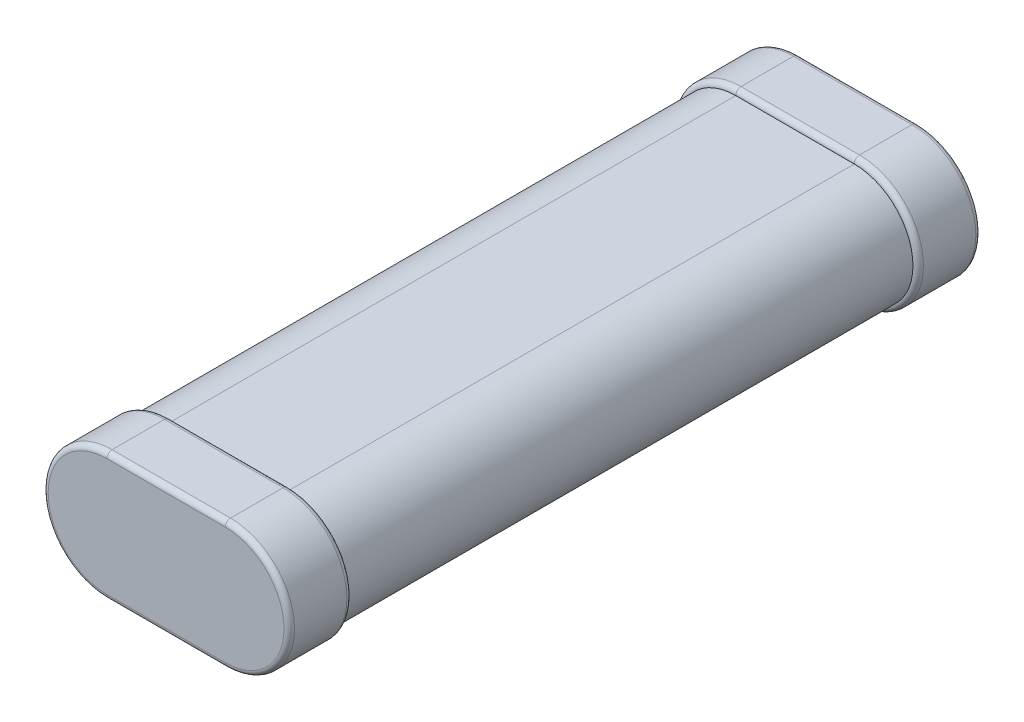
ISO-10303-21;
HEADER;
FILE_DESCRIPTION(('STEP AP214'),'2;1');
FILE_NAME('part.step','',(''),(''),'','','');
FILE_SCHEMA(('AUTOMOTIVE_DESIGN { 1 0 10303 214 1 1 1 1 }'));
ENDSEC;
DATA;
#1=APPLICATION_CONTEXT('core data for automotive mechanical design processes');
#2=APPLICATION_PROTOCOL_DEFINITION('international standard','automotive_design',2000,#1);
#3=PRODUCT_CONTEXT('',#1,'mechanical');
#4=PRODUCT('Part','Part','',(#3));
#5=PRODUCT_RELATED_PRODUCT_CATEGORY('part','',(#4));
#6=PRODUCT_DEFINITION_FORMATION('','',#4);
#7=PRODUCT_DEFINITION_CONTEXT('part definition',#1,'design');
#8=PRODUCT_DEFINITION('design','',#6,#7);
#9=PRODUCT_DEFINITION_SHAPE('','',#8);
#10=(LENGTH_UNIT() NAMED_UNIT(*) SI_UNIT(.MILLI.,.METRE.));
#11=(NAMED_UNIT(*) PLANE_ANGLE_UNIT() SI_UNIT($,.RADIAN.));
#12=(NAMED_UNIT(*) SI_UNIT($,.STERADIAN.) SOLID_ANGLE_UNIT());
#13=UNCERTAINTY_MEASURE_WITH_UNIT(LENGTH_MEASURE(1.E-05),#10,'distance_accuracy_value','');
#14=(GEOMETRIC_REPRESENTATION_CONTEXT(3) GLOBAL_UNCERTAINTY_ASSIGNED_CONTEXT((#13)) GLOBAL_UNIT_ASSIGNED_CONTEXT((#10,
#11,#12)) REPRESENTATION_CONTEXT('',''));
#15=CARTESIAN_POINT('',(0.,0.,0.));
#16=DIRECTION('',(0.,0.,1.));
#17=DIRECTION('',(1.,0.,0.));
#18=AXIS2_PLACEMENT_3D('',#15,#16,#17);
#19=CARTESIAN_POINT('',(-11.3,0.,132.));
#20=DIRECTION('',(0.,0.,-1.));
#21=DIRECTION('',(-1.,0.,0.));
#22=AXIS2_PLACEMENT_3D('',#19,#20,#21);
#23=CYLINDRICAL_SURFACE('',#22,12.2);
#24=DIRECTION('',(0.,0.,-1.));
#25=VECTOR('',#24,1.);
#26=CARTESIAN_POINT('',(-11.3,-12.2,132.));
#27=LINE('',#26,#25);
#28=CARTESIAN_POINT('',(-11.3,-12.2,131.));
#29=VERTEX_POINT('',#28);
#30=CARTESIAN_POINT('',(-11.3,-12.2,121.));
#31=VERTEX_POINT('',#30);
#32=EDGE_CURVE('E220',#29,#31,#27,.T.);
#33=ORIENTED_EDGE('',*,*,#32,.F.);
#34=CARTESIAN_POINT('',(-11.3,0.,131.));
#35=DIRECTION('',(0.,0.,1.));
#36=DIRECTION('',(1.,0.,0.));
#37=AXIS2_PLACEMENT_3D('',#34,#35,#36);
#38=CIRCLE('',#37,12.2);
#39=CARTESIAN_POINT('',(-11.3,12.2,131.));
#40=VERTEX_POINT('',#39);
#41=EDGE_CURVE('E240',#29,#40,#38,.F.);
#42=ORIENTED_EDGE('',*,*,#41,.T.);
#43=DIRECTION('',(0.,0.,-1.));
#44=VECTOR('',#43,1.);
#45=CARTESIAN_POINT('',(-11.3,12.2,132.));
#46=LINE('',#45,#44);
#47=CARTESIAN_POINT('',(-11.3,12.2,121.));
#48=VERTEX_POINT('',#47);
#49=EDGE_CURVE('E209',#40,#48,#46,.T.);
#50=ORIENTED_EDGE('',*,*,#49,.T.);
#51=CARTESIAN_POINT('',(-11.3,0.,121.));
#52=DIRECTION('',(0.,0.,-1.));
#53=DIRECTION('',(-1.,0.,0.));
#54=AXIS2_PLACEMENT_3D('',#51,#52,#53);
#55=CIRCLE('',#54,12.2);
#56=EDGE_CURVE('E158',#48,#31,#55,.F.);
#57=ORIENTED_EDGE('',*,*,#56,.T.);
#58=EDGE_LOOP('',(#33,#42,#50,#57));
#59=FACE_BOUND('',#58,.T.);
#60=ADVANCED_FACE('F34',(#59),#23,.T.);
#61=CARTESIAN_POINT('',(-11.3,-12.2,132.));
#62=DIRECTION('',(0.,1.,0.));
#63=DIRECTION('',(-1.,0.,0.));
#64=AXIS2_PLACEMENT_3D('',#61,#62,#63);
#65=PLANE('',#64);
#66=DIRECTION('',(0.,0.,-1.));
#67=VECTOR('',#66,1.);
#68=CARTESIAN_POINT('',(11.3,-12.2,132.));
#69=LINE('',#68,#67);
#70=CARTESIAN_POINT('',(11.3,-12.2,131.));
#71=VERTEX_POINT('',#70);
#72=CARTESIAN_POINT('',(11.3,-12.2,121.));
#73=VERTEX_POINT('',#72);
#74=EDGE_CURVE('E216',#71,#73,#69,.T.);
#75=ORIENTED_EDGE('',*,*,#74,.F.);
#76=DIRECTION('',(1.,0.,0.));
#77=VECTOR('',#76,1.);
#78=CARTESIAN_POINT('',(-11.3,-12.2,131.));
#79=LINE('',#78,#77);
#80=EDGE_CURVE('E237',#71,#29,#79,.F.);
#81=ORIENTED_EDGE('',*,*,#80,.T.);
#82=ORIENTED_EDGE('',*,*,#32,.T.);
#83=DIRECTION('',(-1.,0.,0.));
#84=VECTOR('',#83,1.);
#85=CARTESIAN_POINT('',(11.3,-12.2,121.));
#86=LINE('',#85,#84);
#87=EDGE_CURVE('E235',#31,#73,#86,.F.);
#88=ORIENTED_EDGE('',*,*,#87,.T.);
#89=EDGE_LOOP('',(#75,#81,#82,#88));
#90=FACE_BOUND('',#89,.T.);
#91=ADVANCED_FACE('F330',(#90),#65,.F.);
#92=CARTESIAN_POINT('',(11.3,0.,132.));
#93=DIRECTION('',(0.,0.,-1.));
#94=DIRECTION('',(-1.,0.,0.));
#95=AXIS2_PLACEMENT_3D('',#92,#93,#94);
#96=CYLINDRICAL_SURFACE('',#95,12.2);
#97=DIRECTION('',(0.,0.,-1.));
#98=VECTOR('',#97,1.);
#99=CARTESIAN_POINT('',(11.3,12.2,132.));
#100=LINE('',#99,#98);
#101=CARTESIAN_POINT('',(11.3,12.2,131.));
#102=VERTEX_POINT('',#101);
#103=CARTESIAN_POINT('',(11.3,12.2,121.));
#104=VERTEX_POINT('',#103);
#105=EDGE_CURVE('E212',#102,#104,#100,.T.);
#106=ORIENTED_EDGE('',*,*,#105,.F.);
#107=CARTESIAN_POINT('',(11.3,0.,131.));
#108=DIRECTION('',(0.,0.,1.));
#109=DIRECTION('',(1.,0.,0.));
#110=AXIS2_PLACEMENT_3D('',#107,#108,#109);
#111=CIRCLE('',#110,12.2);
#112=EDGE_CURVE('E232',#102,#71,#111,.F.);
#113=ORIENTED_EDGE('',*,*,#112,.T.);
#114=ORIENTED_EDGE('',*,*,#74,.T.);
#115=CARTESIAN_POINT('',(11.3,0.,121.));
#116=DIRECTION('',(0.,0.,-1.));
#117=DIRECTION('',(-1.,0.,0.));
#118=AXIS2_PLACEMENT_3D('',#115,#116,#117);
#119=CIRCLE('',#118,12.2);
#120=EDGE_CURVE('E230',#73,#104,#119,.F.);
#121=ORIENTED_EDGE('',*,*,#120,.T.);
#122=EDGE_LOOP('',(#106,#113,#114,#121));
#123=FACE_BOUND('',#122,.T.);
#124=ADVANCED_FACE('F311',(#123),#96,.T.);
#125=CARTESIAN_POINT('',(-11.3,12.2,132.));
#126=DIRECTION('',(0.,-1.,0.));
#127=DIRECTION('',(1.,0.,0.));
#128=AXIS2_PLACEMENT_3D('',#125,#126,#127);
#129=PLANE('',#128);
#130=ORIENTED_EDGE('',*,*,#49,.F.);
#131=DIRECTION('',(-1.,0.,0.));
#132=VECTOR('',#131,1.);
#133=CARTESIAN_POINT('',(11.3,12.2,131.));
#134=LINE('',#133,#132);
#135=EDGE_CURVE('E267',#40,#102,#134,.F.);
#136=ORIENTED_EDGE('',*,*,#135,.T.);
#137=ORIENTED_EDGE('',*,*,#105,.T.);
#138=DIRECTION('',(1.,0.,0.));
#139=VECTOR('',#138,1.);
#140=CARTESIAN_POINT('',(-11.3,12.2,121.));
#141=LINE('',#140,#139);
#142=EDGE_CURVE('E265',#104,#48,#141,.F.);
#143=ORIENTED_EDGE('',*,*,#142,.T.);
#144=EDGE_LOOP('',(#130,#136,#137,#143));
#145=FACE_BOUND('',#144,.T.);
#146=ADVANCED_FACE('F316',(#145),#129,.F.);
#147=CARTESIAN_POINT('',(-11.3,0.,132.));
#148=DIRECTION('',(0.,0.,1.));
#149=DIRECTION('',(1.,0.,0.));
#150=AXIS2_PLACEMENT_3D('',#147,#148,#149);
#151=PLANE('',#150);
#152=DIRECTION('',(1.,0.,0.));
#153=VECTOR('',#152,1.);
#154=CARTESIAN_POINT('',(11.3,-11.2,132.));
#155=LINE('',#154,#153);
#156=CARTESIAN_POINT('',(-11.3,-11.2,132.));
#157=VERTEX_POINT('',#156);
#158=CARTESIAN_POINT('',(11.3,-11.2,132.));
#159=VERTEX_POINT('',#158);
#160=EDGE_CURVE('E225',#157,#159,#155,.T.);
#161=ORIENTED_EDGE('',*,*,#160,.T.);
#162=CARTESIAN_POINT('',(11.3,0.,132.));
#163=DIRECTION('',(0.,0.,1.));
#164=DIRECTION('',(1.,0.,0.));
#165=AXIS2_PLACEMENT_3D('',#162,#163,#164);
#166=CIRCLE('',#165,11.2);
#167=CARTESIAN_POINT('',(11.3,11.2,132.));
#168=VERTEX_POINT('',#167);
#169=EDGE_CURVE('E227',#159,#168,#166,.T.);
#170=ORIENTED_EDGE('',*,*,#169,.T.);
#171=DIRECTION('',(-1.,0.,0.));
#172=VECTOR('',#171,1.);
#173=CARTESIAN_POINT('',(-11.3,11.2,132.));
#174=LINE('',#173,#172);
#175=CARTESIAN_POINT('',(-11.3,11.2,132.));
#176=VERTEX_POINT('',#175);
#177=EDGE_CURVE('E221',#168,#176,#174,.T.);
#178=ORIENTED_EDGE('',*,*,#177,.T.);
#179=CARTESIAN_POINT('',(-11.3,0.,132.));
#180=DIRECTION('',(0.,0.,1.));
#181=DIRECTION('',(1.,0.,0.));
#182=AXIS2_PLACEMENT_3D('',#179,#180,#181);
#183=CIRCLE('',#182,11.2);
#184=EDGE_CURVE('E223',#176,#157,#183,.T.);
#185=ORIENTED_EDGE('',*,*,#184,.T.);
#186=EDGE_LOOP('',(#161,#170,#178,#185));
#187=FACE_BOUND('',#186,.T.);
#188=ADVANCED_FACE('F343',(#187),#151,.T.);
#189=CARTESIAN_POINT('',(-11.3,0.,120.));
#190=DIRECTION('',(0.,0.,-1.));
#191=DIRECTION('',(-1.,0.,0.));
#192=AXIS2_PLACEMENT_3D('',#189,#190,#191);
#193=CYLINDRICAL_SURFACE('',#192,11.2);
#194=CARTESIAN_POINT('',(-11.3,0.,12.));
#195=DIRECTION('',(0.,0.,-1.));
#196=DIRECTION('',(-1.,0.,0.));
#197=AXIS2_PLACEMENT_3D('',#194,#195,#196);
#198=CIRCLE('',#197,11.2);
#199=CARTESIAN_POINT('',(-11.3,-11.2,12.));
#200=VERTEX_POINT('',#199);
#201=CARTESIAN_POINT('',(-11.3,11.2,12.));
#202=VERTEX_POINT('',#201);
#203=EDGE_CURVE('E197',#200,#202,#198,.T.);
#204=ORIENTED_EDGE('',*,*,#203,.F.);
#205=DIRECTION('',(0.,0.,-1.));
#206=VECTOR('',#205,1.);
#207=CARTESIAN_POINT('',(-11.3,-11.2,120.));
#208=LINE('',#207,#206);
#209=CARTESIAN_POINT('',(-11.3,-11.2,120.));
#210=VERTEX_POINT('',#209);
#211=EDGE_CURVE('E186',#210,#200,#208,.T.);
#212=ORIENTED_EDGE('',*,*,#211,.F.);
#213=CARTESIAN_POINT('',(-11.3,0.,120.));
#214=DIRECTION('',(0.,0.,-1.));
#215=DIRECTION('',(-1.,0.,0.));
#216=AXIS2_PLACEMENT_3D('',#213,#214,#215);
#217=CIRCLE('',#216,11.2);
#218=CARTESIAN_POINT('',(-11.3,11.2,120.));
#219=VERTEX_POINT('',#218);
#220=EDGE_CURVE('E156',#210,#219,#217,.T.);
#221=ORIENTED_EDGE('',*,*,#220,.T.);
#222=DIRECTION('',(0.,0.,-1.));
#223=VECTOR('',#222,1.);
#224=CARTESIAN_POINT('',(-11.3,11.2,120.));
#225=LINE('',#224,#223);
#226=EDGE_CURVE('E175',#219,#202,#225,.T.);
#227=ORIENTED_EDGE('',*,*,#226,.T.);
#228=EDGE_LOOP('',(#204,#212,#221,#227));
#229=FACE_BOUND('',#228,.T.);
#230=ADVANCED_FACE('F184',(#229),#193,.T.);
#231=CARTESIAN_POINT('',(11.3,-11.2,120.));
#232=DIRECTION('',(0.,-1.,0.));
#233=DIRECTION('',(1.,0.,0.));
#234=AXIS2_PLACEMENT_3D('',#231,#232,#233);
#235=PLANE('',#234);
#236=DIRECTION('',(-1.,0.,0.));
#237=VECTOR('',#236,1.);
#238=CARTESIAN_POINT('',(11.3,-11.2,12.));
#239=LINE('',#238,#237);
#240=CARTESIAN_POINT('',(11.3,-11.2,12.));
#241=VERTEX_POINT('',#240);
#242=EDGE_CURVE('E188',#241,#200,#239,.T.);
#243=ORIENTED_EDGE('',*,*,#242,.F.);
#244=DIRECTION('',(0.,0.,-1.));
#245=VECTOR('',#244,1.);
#246=CARTESIAN_POINT('',(11.3,-11.2,120.));
#247=LINE('',#246,#245);
#248=CARTESIAN_POINT('',(11.3,-11.2,120.));
#249=VERTEX_POINT('',#248);
#250=EDGE_CURVE('E205',#249,#241,#247,.T.);
#251=ORIENTED_EDGE('',*,*,#250,.F.);
#252=DIRECTION('',(-1.,0.,0.));
#253=VECTOR('',#252,1.);
#254=CARTESIAN_POINT('',(11.3,-11.2,120.));
#255=LINE('',#254,#253);
#256=EDGE_CURVE('E182',#249,#210,#255,.T.);
#257=ORIENTED_EDGE('',*,*,#256,.T.);
#258=ORIENTED_EDGE('',*,*,#211,.T.);
#259=EDGE_LOOP('',(#243,#251,#257,#258));
#260=FACE_BOUND('',#259,.T.);
#261=ADVANCED_FACE('F350',(#260),#235,.T.);
#262=CARTESIAN_POINT('',(11.3,0.,120.));
#263=DIRECTION('',(0.,0.,-1.));
#264=DIRECTION('',(-1.,0.,0.));
#265=AXIS2_PLACEMENT_3D('',#262,#263,#264);
#266=CYLINDRICAL_SURFACE('',#265,11.2);
#267=CARTESIAN_POINT('',(11.3,0.,12.));
#268=DIRECTION('',(0.,0.,-1.));
#269=DIRECTION('',(-1.,0.,0.));
#270=AXIS2_PLACEMENT_3D('',#267,#268,#269);
#271=CIRCLE('',#270,11.2);
#272=CARTESIAN_POINT('',(11.3,11.2,12.));
#273=VERTEX_POINT('',#272);
#274=EDGE_CURVE('E191',#273,#241,#271,.T.);
#275=ORIENTED_EDGE('',*,*,#274,.F.);
#276=DIRECTION('',(0.,0.,-1.));
#277=VECTOR('',#276,1.);
#278=CARTESIAN_POINT('',(11.3,11.2,120.));
#279=LINE('',#278,#277);
#280=CARTESIAN_POINT('',(11.3,11.2,120.));
#281=VERTEX_POINT('',#280);
#282=EDGE_CURVE('E181',#281,#273,#279,.T.);
#283=ORIENTED_EDGE('',*,*,#282,.F.);
#284=CARTESIAN_POINT('',(11.3,0.,120.));
#285=DIRECTION('',(0.,0.,-1.));
#286=DIRECTION('',(-1.,0.,0.));
#287=AXIS2_PLACEMENT_3D('',#284,#285,#286);
#288=CIRCLE('',#287,11.2);
#289=EDGE_CURVE('E172',#281,#249,#288,.T.);
#290=ORIENTED_EDGE('',*,*,#289,.T.);
#291=ORIENTED_EDGE('',*,*,#250,.T.);
#292=EDGE_LOOP('',(#275,#283,#290,#291));
#293=FACE_BOUND('',#292,.T.);
#294=ADVANCED_FACE('F415',(#293),#266,.T.);
#295=CARTESIAN_POINT('',(-11.3,11.2,120.));
#296=DIRECTION('',(0.,1.,0.));
#297=DIRECTION('',(0.,0.,1.));
#298=AXIS2_PLACEMENT_3D('',#295,#296,#297);
#299=PLANE('',#298);
#300=DIRECTION('',(1.,0.,0.));
#301=VECTOR('',#300,1.);
#302=CARTESIAN_POINT('',(-11.3,11.2,12.));
#303=LINE('',#302,#301);
#304=EDGE_CURVE('E178',#202,#273,#303,.T.);
#305=ORIENTED_EDGE('',*,*,#304,.F.);
#306=ORIENTED_EDGE('',*,*,#226,.F.);
#307=DIRECTION('',(1.,0.,0.));
#308=VECTOR('',#307,1.);
#309=CARTESIAN_POINT('',(-11.3,11.2,120.));
#310=LINE('',#309,#308);
#311=EDGE_CURVE('E165',#219,#281,#310,.T.);
#312=ORIENTED_EDGE('',*,*,#311,.T.);
#313=ORIENTED_EDGE('',*,*,#282,.T.);
#314=EDGE_LOOP('',(#305,#306,#312,#313));
#315=FACE_BOUND('',#314,.T.);
#316=ADVANCED_FACE('F176',(#315),#299,.T.);
#317=CARTESIAN_POINT('',(-11.3,0.,0.));
#318=DIRECTION('',(0.,0.,1.));
#319=DIRECTION('',(1.,0.,0.));
#320=AXIS2_PLACEMENT_3D('',#317,#318,#319);
#321=PLANE('',#320);
#322=DIRECTION('',(-1.,0.,0.));
#323=VECTOR('',#322,1.);
#324=CARTESIAN_POINT('',(-11.3,11.2,0.));
#325=LINE('',#324,#323);
#326=CARTESIAN_POINT('',(-11.3,11.2,0.));
#327=VERTEX_POINT('',#326);
#328=CARTESIAN_POINT('',(11.3,11.2,0.));
#329=VERTEX_POINT('',#328);
#330=EDGE_CURVE('E247',#327,#329,#325,.F.);
#331=ORIENTED_EDGE('',*,*,#330,.T.);
#332=CARTESIAN_POINT('',(11.3,0.,0.));
#333=DIRECTION('',(0.,0.,1.));
#334=DIRECTION('',(1.,0.,0.));
#335=AXIS2_PLACEMENT_3D('',#332,#333,#334);
#336=CIRCLE('',#335,11.2);
#337=CARTESIAN_POINT('',(11.3,-11.2,0.));
#338=VERTEX_POINT('',#337);
#339=EDGE_CURVE('E253',#329,#338,#336,.F.);
#340=ORIENTED_EDGE('',*,*,#339,.T.);
#341=DIRECTION('',(1.,0.,0.));
#342=VECTOR('',#341,1.);
#343=CARTESIAN_POINT('',(-11.3,-11.2,0.));
#344=LINE('',#343,#342);
#345=CARTESIAN_POINT('',(-11.3,-11.2,0.));
#346=VERTEX_POINT('',#345);
#347=EDGE_CURVE('E251',#338,#346,#344,.F.);
#348=ORIENTED_EDGE('',*,*,#347,.T.);
#349=CARTESIAN_POINT('',(-11.3,0.,0.));
#350=DIRECTION('',(0.,0.,1.));
#351=DIRECTION('',(1.,0.,0.));
#352=AXIS2_PLACEMENT_3D('',#349,#350,#351);
#353=CIRCLE('',#352,11.2);
#354=EDGE_CURVE('E249',#346,#327,#353,.F.);
#355=ORIENTED_EDGE('',*,*,#354,.T.);
#356=EDGE_LOOP('',(#331,#340,#348,#355));
#357=FACE_BOUND('',#356,.T.);
#358=ADVANCED_FACE('F387',(#357),#321,.F.);
#359=CARTESIAN_POINT('',(11.3,12.2,11.));
#360=VERTEX_POINT('',#359);
#361=CARTESIAN_POINT('',(11.3,12.2,1.));
#362=VERTEX_POINT('',#361);
#363=EDGE_CURVE('E210',#360,#362,#100,.T.);
#364=ORIENTED_EDGE('',*,*,#363,.T.);
#365=DIRECTION('',(-1.,0.,0.));
#366=VECTOR('',#365,1.);
#367=CARTESIAN_POINT('',(-11.3,12.2,1.));
#368=LINE('',#367,#366);
#369=CARTESIAN_POINT('',(-11.3,12.2,1.));
#370=VERTEX_POINT('',#369);
#371=EDGE_CURVE('E11',#362,#370,#368,.T.);
#372=ORIENTED_EDGE('',*,*,#371,.T.);
#373=CARTESIAN_POINT('',(-11.3,12.2,11.));
#374=VERTEX_POINT('',#373);
#375=EDGE_CURVE('E204',#374,#370,#46,.T.);
#376=ORIENTED_EDGE('',*,*,#375,.F.);
#377=DIRECTION('',(1.,0.,0.));
#378=VECTOR('',#377,1.);
#379=CARTESIAN_POINT('',(-11.3,12.2,11.));
#380=LINE('',#379,#378);
#381=EDGE_CURVE('E43',#374,#360,#380,.T.);
#382=ORIENTED_EDGE('',*,*,#381,.T.);
#383=EDGE_LOOP('',(#364,#372,#376,#382));
#384=FACE_BOUND('',#383,.T.);
#385=ADVANCED_FACE('F353',(#384),#129,.F.);
#386=CARTESIAN_POINT('',(11.3,-12.2,11.));
#387=VERTEX_POINT('',#386);
#388=CARTESIAN_POINT('',(11.3,-12.2,1.));
#389=VERTEX_POINT('',#388);
#390=EDGE_CURVE('E213',#387,#389,#69,.T.);
#391=ORIENTED_EDGE('',*,*,#390,.T.);
#392=CARTESIAN_POINT('',(11.3,0.,1.));
#393=DIRECTION('',(0.,0.,1.));
#394=DIRECTION('',(1.,0.,0.));
#395=AXIS2_PLACEMENT_3D('',#392,#393,#394);
#396=CIRCLE('',#395,12.2);
#397=EDGE_CURVE('E244',#389,#362,#396,.T.);
#398=ORIENTED_EDGE('',*,*,#397,.T.);
#399=ORIENTED_EDGE('',*,*,#363,.F.);
#400=CARTESIAN_POINT('',(11.3,0.,11.));
#401=DIRECTION('',(0.,0.,-1.));
#402=DIRECTION('',(-1.,0.,0.));
#403=AXIS2_PLACEMENT_3D('',#400,#401,#402);
#404=CIRCLE('',#403,12.2);
#405=EDGE_CURVE('E242',#360,#387,#404,.T.);
#406=ORIENTED_EDGE('',*,*,#405,.T.);
#407=EDGE_LOOP('',(#391,#398,#399,#406));
#408=FACE_BOUND('',#407,.T.);
#409=ADVANCED_FACE('F371',(#408),#96,.T.);
#410=CARTESIAN_POINT('',(-11.3,-12.2,11.));
#411=VERTEX_POINT('',#410);
#412=CARTESIAN_POINT('',(-11.3,-12.2,1.));
#413=VERTEX_POINT('',#412);
#414=EDGE_CURVE('E217',#411,#413,#27,.T.);
#415=ORIENTED_EDGE('',*,*,#414,.T.);
#416=DIRECTION('',(1.,0.,0.));
#417=VECTOR('',#416,1.);
#418=CARTESIAN_POINT('',(-11.3,-12.2,1.));
#419=LINE('',#418,#417);
#420=EDGE_CURVE('E258',#413,#389,#419,.T.);
#421=ORIENTED_EDGE('',*,*,#420,.T.);
#422=ORIENTED_EDGE('',*,*,#390,.F.);
#423=DIRECTION('',(-1.,0.,0.));
#424=VECTOR('',#423,1.);
#425=CARTESIAN_POINT('',(-11.3,-12.2,11.));
#426=LINE('',#425,#424);
#427=EDGE_CURVE('E256',#387,#411,#426,.T.);
#428=ORIENTED_EDGE('',*,*,#427,.T.);
#429=EDGE_LOOP('',(#415,#421,#422,#428));
#430=FACE_BOUND('',#429,.T.);
#431=ADVANCED_FACE('F362',(#430),#65,.F.);
#432=ORIENTED_EDGE('',*,*,#375,.T.);
#433=CARTESIAN_POINT('',(-11.3,0.,1.));
#434=DIRECTION('',(0.,0.,1.));
#435=DIRECTION('',(1.,0.,0.));
#436=AXIS2_PLACEMENT_3D('',#433,#434,#435);
#437=CIRCLE('',#436,12.2);
#438=EDGE_CURVE('E263',#370,#413,#437,.T.);
#439=ORIENTED_EDGE('',*,*,#438,.T.);
#440=ORIENTED_EDGE('',*,*,#414,.F.);
#441=CARTESIAN_POINT('',(-11.3,0.,11.));
#442=DIRECTION('',(0.,0.,-1.));
#443=DIRECTION('',(-1.,0.,0.));
#444=AXIS2_PLACEMENT_3D('',#441,#442,#443);
#445=CIRCLE('',#444,12.2);
#446=EDGE_CURVE('E260',#411,#374,#445,.T.);
#447=ORIENTED_EDGE('',*,*,#446,.T.);
#448=EDGE_LOOP('',(#432,#439,#440,#447));
#449=FACE_BOUND('',#448,.T.);
#450=ADVANCED_FACE('F357',(#449),#23,.T.);
#451=CARTESIAN_POINT('',(-11.3,0.,131.));
#452=DIRECTION('',(0.,0.,1.));
#453=DIRECTION('',(1.,0.,0.));
#454=AXIS2_PLACEMENT_3D('',#451,#452,#453);
#455=TOROIDAL_SURFACE('',#454,11.2,1.);
#456=CARTESIAN_POINT('',(-11.3,11.2,131.));
#457=DIRECTION('',(1.,0.,0.));
#458=DIRECTION('',(0.,0.,-1.));
#459=AXIS2_PLACEMENT_3D('',#456,#457,#458);
#460=CIRCLE('',#459,1.);
#461=EDGE_CURVE('E275',#40,#176,#460,.T.);
#462=ORIENTED_EDGE('',*,*,#461,.F.);
#463=ORIENTED_EDGE('',*,*,#41,.F.);
#464=CARTESIAN_POINT('',(-11.3,-11.2,131.));
#465=DIRECTION('',(1.,0.,0.));
#466=DIRECTION('',(0.,0.,-1.));
#467=AXIS2_PLACEMENT_3D('',#464,#465,#466);
#468=CIRCLE('',#467,1.);
#469=EDGE_CURVE('E199',#157,#29,#468,.T.);
#470=ORIENTED_EDGE('',*,*,#469,.F.);
#471=ORIENTED_EDGE('',*,*,#184,.F.);
#472=EDGE_LOOP('',(#462,#463,#470,#471));
#473=FACE_BOUND('',#472,.T.);
#474=ADVANCED_FACE('F337',(#473),#455,.T.);
#475=CARTESIAN_POINT('',(-11.3,-11.2,131.));
#476=DIRECTION('',(-1.,0.,0.));
#477=DIRECTION('',(0.,-1.,0.));
#478=AXIS2_PLACEMENT_3D('',#475,#476,#477);
#479=CYLINDRICAL_SURFACE('',#478,1.);
#480=ORIENTED_EDGE('',*,*,#469,.T.);
#481=ORIENTED_EDGE('',*,*,#80,.F.);
#482=CARTESIAN_POINT('',(11.3,-11.2,131.));
#483=DIRECTION('',(1.,0.,0.));
#484=DIRECTION('',(0.,0.,-1.));
#485=AXIS2_PLACEMENT_3D('',#482,#483,#484);
#486=CIRCLE('',#485,1.);
#487=EDGE_CURVE('E272',#159,#71,#486,.T.);
#488=ORIENTED_EDGE('',*,*,#487,.F.);
#489=ORIENTED_EDGE('',*,*,#160,.F.);
#490=EDGE_LOOP('',(#480,#481,#488,#489));
#491=FACE_BOUND('',#490,.T.);
#492=ADVANCED_FACE('F341',(#491),#479,.T.);
#493=CARTESIAN_POINT('',(-11.3,11.2,131.));
#494=DIRECTION('',(1.,0.,0.));
#495=DIRECTION('',(0.,1.,0.));
#496=AXIS2_PLACEMENT_3D('',#493,#494,#495);
#497=CYLINDRICAL_SURFACE('',#496,1.);
#498=ORIENTED_EDGE('',*,*,#461,.T.);
#499=ORIENTED_EDGE('',*,*,#177,.F.);
#500=CARTESIAN_POINT('',(11.3,11.2,131.));
#501=DIRECTION('',(1.,0.,0.));
#502=DIRECTION('',(0.,0.,-1.));
#503=AXIS2_PLACEMENT_3D('',#500,#501,#502);
#504=CIRCLE('',#503,1.);
#505=EDGE_CURVE('E270',#102,#168,#504,.T.);
#506=ORIENTED_EDGE('',*,*,#505,.F.);
#507=ORIENTED_EDGE('',*,*,#135,.F.);
#508=EDGE_LOOP('',(#498,#499,#506,#507));
#509=FACE_BOUND('',#508,.T.);
#510=ADVANCED_FACE('F322',(#509),#497,.T.);
#511=CARTESIAN_POINT('',(11.3,0.,131.));
#512=DIRECTION('',(0.,0.,1.));
#513=DIRECTION('',(1.,0.,0.));
#514=AXIS2_PLACEMENT_3D('',#511,#512,#513);
#515=TOROIDAL_SURFACE('',#514,11.2,1.);
#516=ORIENTED_EDGE('',*,*,#487,.T.);
#517=ORIENTED_EDGE('',*,*,#112,.F.);
#518=ORIENTED_EDGE('',*,*,#505,.T.);
#519=ORIENTED_EDGE('',*,*,#169,.F.);
#520=EDGE_LOOP('',(#516,#517,#518,#519));
#521=FACE_BOUND('',#520,.T.);
#522=ADVANCED_FACE('F326',(#521),#515,.T.);
#523=CARTESIAN_POINT('',(-11.3,0.,1.));
#524=DIRECTION('',(0.,0.,1.));
#525=DIRECTION('',(1.,0.,0.));
#526=AXIS2_PLACEMENT_3D('',#523,#524,#525);
#527=TOROIDAL_SURFACE('',#526,11.2,1.);
#528=CARTESIAN_POINT('',(-11.3,11.2,1.));
#529=DIRECTION('',(1.,0.,0.));
#530=DIRECTION('',(0.,0.,-1.));
#531=AXIS2_PLACEMENT_3D('',#528,#529,#530);
#532=CIRCLE('',#531,1.);
#533=EDGE_CURVE('E285',#327,#370,#532,.T.);
#534=ORIENTED_EDGE('',*,*,#533,.F.);
#535=ORIENTED_EDGE('',*,*,#354,.F.);
#536=CARTESIAN_POINT('',(-11.3,-11.2,1.));
#537=DIRECTION('',(1.,0.,0.));
#538=DIRECTION('',(0.,0.,-1.));
#539=AXIS2_PLACEMENT_3D('',#536,#537,#538);
#540=CIRCLE('',#539,1.);
#541=EDGE_CURVE('E273',#413,#346,#540,.T.);
#542=ORIENTED_EDGE('',*,*,#541,.F.);
#543=ORIENTED_EDGE('',*,*,#438,.F.);
#544=EDGE_LOOP('',(#534,#535,#542,#543));
#545=FACE_BOUND('',#544,.T.);
#546=ADVANCED_FACE('F378',(#545),#527,.T.);
#547=CARTESIAN_POINT('',(-11.3,-11.2,1.));
#548=DIRECTION('',(1.,0.,0.));
#549=DIRECTION('',(0.,1.,0.));
#550=AXIS2_PLACEMENT_3D('',#547,#548,#549);
#551=CYLINDRICAL_SURFACE('',#550,1.);
#552=ORIENTED_EDGE('',*,*,#541,.T.);
#553=ORIENTED_EDGE('',*,*,#347,.F.);
#554=CARTESIAN_POINT('',(11.3,-11.2,1.));
#555=DIRECTION('',(1.,0.,0.));
#556=DIRECTION('',(0.,0.,-1.));
#557=AXIS2_PLACEMENT_3D('',#554,#555,#556);
#558=CIRCLE('',#557,1.);
#559=EDGE_CURVE('E282',#389,#338,#558,.T.);
#560=ORIENTED_EDGE('',*,*,#559,.F.);
#561=ORIENTED_EDGE('',*,*,#420,.F.);
#562=EDGE_LOOP('',(#552,#553,#560,#561));
#563=FACE_BOUND('',#562,.T.);
#564=ADVANCED_FACE('F394',(#563),#551,.T.);
#565=CARTESIAN_POINT('',(-11.3,11.2,1.));
#566=DIRECTION('',(-1.,0.,0.));
#567=DIRECTION('',(0.,-1.,0.));
#568=AXIS2_PLACEMENT_3D('',#565,#566,#567);
#569=CYLINDRICAL_SURFACE('',#568,1.);
#570=ORIENTED_EDGE('',*,*,#533,.T.);
#571=ORIENTED_EDGE('',*,*,#371,.F.);
#572=CARTESIAN_POINT('',(11.3,11.2,1.));
#573=DIRECTION('',(1.,0.,0.));
#574=DIRECTION('',(0.,0.,-1.));
#575=AXIS2_PLACEMENT_3D('',#572,#573,#574);
#576=CIRCLE('',#575,1.);
#577=EDGE_CURVE('E280',#329,#362,#576,.T.);
#578=ORIENTED_EDGE('',*,*,#577,.F.);
#579=ORIENTED_EDGE('',*,*,#330,.F.);
#580=EDGE_LOOP('',(#570,#571,#578,#579));
#581=FACE_BOUND('',#580,.T.);
#582=ADVANCED_FACE('F383',(#581),#569,.T.);
#583=CARTESIAN_POINT('',(11.3,0.,1.));
#584=DIRECTION('',(0.,0.,1.));
#585=DIRECTION('',(1.,0.,0.));
#586=AXIS2_PLACEMENT_3D('',#583,#584,#585);
#587=TOROIDAL_SURFACE('',#586,11.2,1.);
#588=ORIENTED_EDGE('',*,*,#559,.T.);
#589=ORIENTED_EDGE('',*,*,#339,.F.);
#590=ORIENTED_EDGE('',*,*,#577,.T.);
#591=ORIENTED_EDGE('',*,*,#397,.F.);
#592=EDGE_LOOP('',(#588,#589,#590,#591));
#593=FACE_BOUND('',#592,.T.);
#594=ADVANCED_FACE('F389',(#593),#587,.T.);
#595=CARTESIAN_POINT('',(11.3,0.,11.));
#596=DIRECTION('',(0.,0.,-1.));
#597=DIRECTION('',(-1.,0.,0.));
#598=AXIS2_PLACEMENT_3D('',#595,#596,#597);
#599=TOROIDAL_SURFACE('',#598,11.2,1.);
#600=CARTESIAN_POINT('',(11.3,11.2,11.));
#601=DIRECTION('',(-1.,0.,0.));
#602=DIRECTION('',(0.,0.,1.));
#603=AXIS2_PLACEMENT_3D('',#600,#601,#602);
#604=CIRCLE('',#603,1.);
#605=EDGE_CURVE('E293',#273,#360,#604,.T.);
#606=ORIENTED_EDGE('',*,*,#605,.F.);
#607=ORIENTED_EDGE('',*,*,#274,.T.);
#608=CARTESIAN_POINT('',(11.3,-11.2,11.));
#609=DIRECTION('',(-1.,0.,0.));
#610=DIRECTION('',(0.,0.,1.));
#611=AXIS2_PLACEMENT_3D('',#608,#609,#610);
#612=CIRCLE('',#611,1.);
#613=EDGE_CURVE('E283',#387,#241,#612,.T.);
#614=ORIENTED_EDGE('',*,*,#613,.F.);
#615=ORIENTED_EDGE('',*,*,#405,.F.);
#616=EDGE_LOOP('',(#606,#607,#614,#615));
#617=FACE_BOUND('',#616,.T.);
#618=ADVANCED_FACE('F402',(#617),#599,.T.);
#619=CARTESIAN_POINT('',(-11.3,-11.2,11.));
#620=DIRECTION('',(-1.,0.,0.));
#621=DIRECTION('',(0.,-1.,0.));
#622=AXIS2_PLACEMENT_3D('',#619,#620,#621);
#623=CYLINDRICAL_SURFACE('',#622,1.);
#624=ORIENTED_EDGE('',*,*,#613,.T.);
#625=ORIENTED_EDGE('',*,*,#242,.T.);
#626=CARTESIAN_POINT('',(-11.3,-11.2,11.));
#627=DIRECTION('',(-1.,0.,0.));
#628=DIRECTION('',(0.,0.,1.));
#629=AXIS2_PLACEMENT_3D('',#626,#627,#628);
#630=CIRCLE('',#629,1.);
#631=EDGE_CURVE('E291',#411,#200,#630,.T.);
#632=ORIENTED_EDGE('',*,*,#631,.F.);
#633=ORIENTED_EDGE('',*,*,#427,.F.);
#634=EDGE_LOOP('',(#624,#625,#632,#633));
#635=FACE_BOUND('',#634,.T.);
#636=ADVANCED_FACE('F431',(#635),#623,.T.);
#637=CARTESIAN_POINT('',(-11.3,11.2,11.));
#638=DIRECTION('',(1.,0.,0.));
#639=DIRECTION('',(0.,1.,0.));
#640=AXIS2_PLACEMENT_3D('',#637,#638,#639);
#641=CYLINDRICAL_SURFACE('',#640,1.);
#642=ORIENTED_EDGE('',*,*,#605,.T.);
#643=ORIENTED_EDGE('',*,*,#381,.F.);
#644=CARTESIAN_POINT('',(-11.3,11.2,11.));
#645=DIRECTION('',(-1.,0.,0.));
#646=DIRECTION('',(0.,0.,1.));
#647=AXIS2_PLACEMENT_3D('',#644,#645,#646);
#648=CIRCLE('',#647,1.);
#649=EDGE_CURVE('E57',#202,#374,#648,.T.);
#650=ORIENTED_EDGE('',*,*,#649,.F.);
#651=ORIENTED_EDGE('',*,*,#304,.T.);
#652=EDGE_LOOP('',(#642,#643,#650,#651));
#653=FACE_BOUND('',#652,.T.);
#654=ADVANCED_FACE('F405',(#653),#641,.T.);
#655=CARTESIAN_POINT('',(-11.3,0.,11.));
#656=DIRECTION('',(0.,0.,-1.));
#657=DIRECTION('',(-1.,0.,0.));
#658=AXIS2_PLACEMENT_3D('',#655,#656,#657);
#659=TOROIDAL_SURFACE('',#658,11.2,1.);
#660=ORIENTED_EDGE('',*,*,#631,.T.);
#661=ORIENTED_EDGE('',*,*,#203,.T.);
#662=ORIENTED_EDGE('',*,*,#649,.T.);
#663=ORIENTED_EDGE('',*,*,#446,.F.);
#664=EDGE_LOOP('',(#660,#661,#662,#663));
#665=FACE_BOUND('',#664,.T.);
#666=ADVANCED_FACE('F432',(#665),#659,.T.);
#667=CARTESIAN_POINT('',(11.3,0.,121.));
#668=DIRECTION('',(0.,0.,-1.));
#669=DIRECTION('',(-1.,0.,0.));
#670=AXIS2_PLACEMENT_3D('',#667,#668,#669);
#671=TOROIDAL_SURFACE('',#670,11.2,1.);
#672=CARTESIAN_POINT('',(11.3,11.2,121.));
#673=DIRECTION('',(-1.,0.,0.));
#674=DIRECTION('',(0.,0.,1.));
#675=AXIS2_PLACEMENT_3D('',#672,#673,#674);
#676=CIRCLE('',#675,1.);
#677=EDGE_CURVE('E169',#104,#281,#676,.T.);
#678=ORIENTED_EDGE('',*,*,#677,.F.);
#679=ORIENTED_EDGE('',*,*,#120,.F.);
#680=CARTESIAN_POINT('',(11.3,-11.2,121.));
#681=DIRECTION('',(-1.,0.,0.));
#682=DIRECTION('',(0.,0.,1.));
#683=AXIS2_PLACEMENT_3D('',#680,#681,#682);
#684=CIRCLE('',#683,1.);
#685=EDGE_CURVE('E38',#249,#73,#684,.T.);
#686=ORIENTED_EDGE('',*,*,#685,.F.);
#687=ORIENTED_EDGE('',*,*,#289,.F.);
#688=EDGE_LOOP('',(#678,#679,#686,#687));
#689=FACE_BOUND('',#688,.T.);
#690=ADVANCED_FACE('F36',(#689),#671,.T.);
#691=CARTESIAN_POINT('',(-11.3,-11.2,121.));
#692=DIRECTION('',(1.,0.,0.));
#693=DIRECTION('',(0.,1.,0.));
#694=AXIS2_PLACEMENT_3D('',#691,#692,#693);
#695=CYLINDRICAL_SURFACE('',#694,1.);
#696=ORIENTED_EDGE('',*,*,#685,.T.);
#697=ORIENTED_EDGE('',*,*,#87,.F.);
#698=CARTESIAN_POINT('',(-11.3,-11.2,121.));
#699=DIRECTION('',(-1.,0.,0.));
#700=DIRECTION('',(0.,0.,1.));
#701=AXIS2_PLACEMENT_3D('',#698,#699,#700);
#702=CIRCLE('',#701,1.);
#703=EDGE_CURVE('E161',#210,#31,#702,.T.);
#704=ORIENTED_EDGE('',*,*,#703,.F.);
#705=ORIENTED_EDGE('',*,*,#256,.F.);
#706=EDGE_LOOP('',(#696,#697,#704,#705));
#707=FACE_BOUND('',#706,.T.);
#708=ADVANCED_FACE('F303',(#707),#695,.T.);
#709=CARTESIAN_POINT('',(-11.3,11.2,121.));
#710=DIRECTION('',(-1.,0.,0.));
#711=DIRECTION('',(0.,-1.,0.));
#712=AXIS2_PLACEMENT_3D('',#709,#710,#711);
#713=CYLINDRICAL_SURFACE('',#712,1.);
#714=ORIENTED_EDGE('',*,*,#677,.T.);
#715=ORIENTED_EDGE('',*,*,#311,.F.);
#716=CARTESIAN_POINT('',(-11.3,11.2,121.));
#717=DIRECTION('',(-1.,0.,0.));
#718=DIRECTION('',(0.,0.,1.));
#719=AXIS2_PLACEMENT_3D('',#716,#717,#718);
#720=CIRCLE('',#719,1.);
#721=EDGE_CURVE('E152',#48,#219,#720,.T.);
#722=ORIENTED_EDGE('',*,*,#721,.F.);
#723=ORIENTED_EDGE('',*,*,#142,.F.);
#724=EDGE_LOOP('',(#714,#715,#722,#723));
#725=FACE_BOUND('',#724,.T.);
#726=ADVANCED_FACE('F167',(#725),#713,.T.);
#727=CARTESIAN_POINT('',(-11.3,0.,121.));
#728=DIRECTION('',(0.,0.,-1.));
#729=DIRECTION('',(-1.,0.,0.));
#730=AXIS2_PLACEMENT_3D('',#727,#728,#729);
#731=TOROIDAL_SURFACE('',#730,11.2,1.);
#732=ORIENTED_EDGE('',*,*,#703,.T.);
#733=ORIENTED_EDGE('',*,*,#56,.F.);
#734=ORIENTED_EDGE('',*,*,#721,.T.);
#735=ORIENTED_EDGE('',*,*,#220,.F.);
#736=EDGE_LOOP('',(#732,#733,#734,#735));
#737=FACE_BOUND('',#736,.T.);
#738=ADVANCED_FACE('F154',(#737),#731,.T.);
#739=CLOSED_SHELL('',(#60,#91,#124,#146,#188,#230,#261,#294,#316,#358,#385,#409,#431,#450,#474,
#492,#510,#522,#546,#564,#582,#594,#618,#636,#654,#666,#690,#708,#726,#738));
#740=MANIFOLD_SOLID_BREP('B2',#739);
#741=ADVANCED_BREP_SHAPE_REPRESENTATION('',(#18,#740),#14);
#742=SHAPE_DEFINITION_REPRESENTATION(#9,#741);
ENDSEC;
END-ISO-10303-21;
